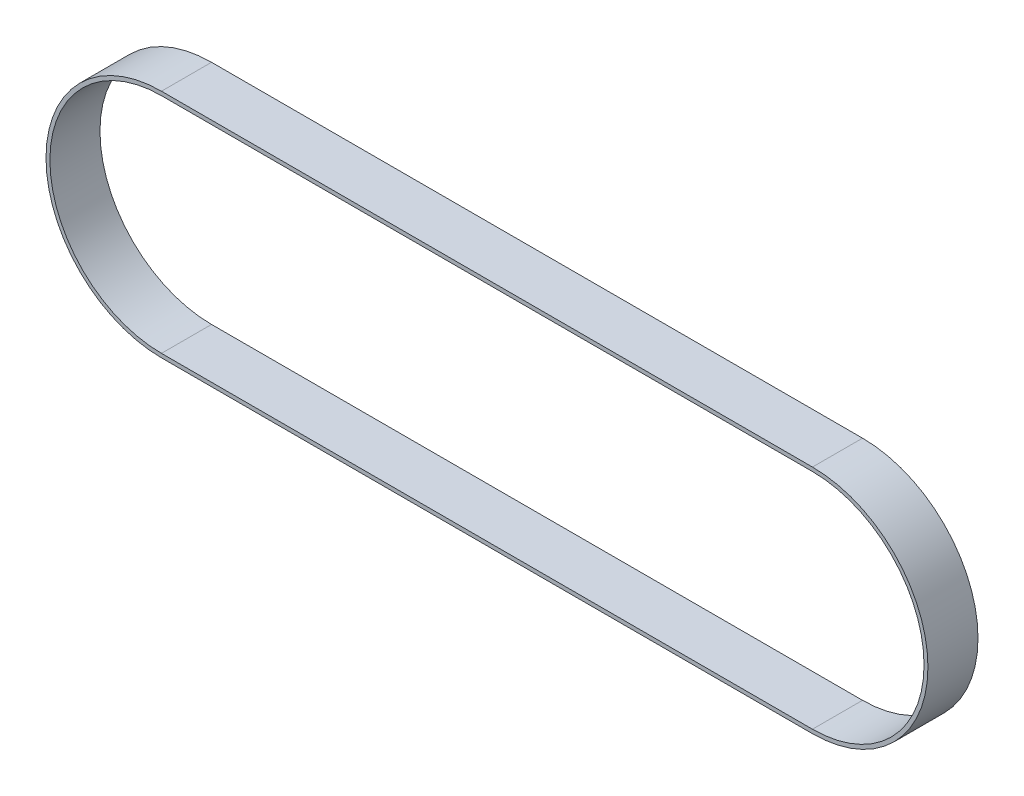
ISO-10303-21;
HEADER;
FILE_DESCRIPTION(('STEP AP214'),'2;1');
FILE_NAME('part.step','',(''),(''),'','','');
FILE_SCHEMA(('AUTOMOTIVE_DESIGN { 1 0 10303 214 1 1 1 1 }'));
ENDSEC;
DATA;
#1=APPLICATION_CONTEXT('core data for automotive mechanical design processes');
#2=APPLICATION_PROTOCOL_DEFINITION('international standard','automotive_design',2000,#1);
#3=PRODUCT_CONTEXT('',#1,'mechanical');
#4=PRODUCT('Part','Part','',(#3));
#5=PRODUCT_RELATED_PRODUCT_CATEGORY('part','',(#4));
#6=PRODUCT_DEFINITION_FORMATION('','',#4);
#7=PRODUCT_DEFINITION_CONTEXT('part definition',#1,'design');
#8=PRODUCT_DEFINITION('design','',#6,#7);
#9=PRODUCT_DEFINITION_SHAPE('','',#8);
#10=(LENGTH_UNIT() NAMED_UNIT(*) SI_UNIT(.MILLI.,.METRE.));
#11=(NAMED_UNIT(*) PLANE_ANGLE_UNIT() SI_UNIT($,.RADIAN.));
#12=(NAMED_UNIT(*) SI_UNIT($,.STERADIAN.) SOLID_ANGLE_UNIT());
#13=UNCERTAINTY_MEASURE_WITH_UNIT(LENGTH_MEASURE(1.E-05),#10,'distance_accuracy_value','');
#14=(GEOMETRIC_REPRESENTATION_CONTEXT(3) GLOBAL_UNCERTAINTY_ASSIGNED_CONTEXT((#13)) GLOBAL_UNIT_ASSIGNED_CONTEXT((#10,
#11,#12)) REPRESENTATION_CONTEXT('',''));
#15=CARTESIAN_POINT('',(0.,0.,0.));
#16=DIRECTION('',(0.,0.,1.));
#17=DIRECTION('',(1.,0.,0.));
#18=AXIS2_PLACEMENT_3D('',#15,#16,#17);
#19=CARTESIAN_POINT('',(0.,0.,15.));
#20=DIRECTION('',(0.,0.,1.));
#21=DIRECTION('',(1.,0.,0.));
#22=AXIS2_PLACEMENT_3D('',#19,#20,#21);
#23=PLANE('',#22);
#24=CARTESIAN_POINT('',(0.,0.,15.));
#25=DIRECTION('',(0.,0.,1.));
#26=DIRECTION('',(1.,0.,0.));
#27=AXIS2_PLACEMENT_3D('',#24,#25,#26);
#28=CIRCLE('',#27,34.5948);
#29=CARTESIAN_POINT('',(0.,34.5948,15.));
#30=VERTEX_POINT('',#29);
#31=CARTESIAN_POINT('',(0.,-34.5948,15.));
#32=VERTEX_POINT('',#31);
#33=EDGE_CURVE('E135',#30,#32,#28,.T.);
#34=ORIENTED_EDGE('',*,*,#33,.T.);
#35=DIRECTION('',(1.,0.,0.));
#36=VECTOR('',#35,1.);
#37=CARTESIAN_POINT('',(0.,-34.5948,15.));
#38=LINE('',#37,#36);
#39=CARTESIAN_POINT('',(195.0466,-34.5948,15.));
#40=VERTEX_POINT('',#39);
#41=EDGE_CURVE('E138',#32,#40,#38,.T.);
#42=ORIENTED_EDGE('',*,*,#41,.T.);
#43=CARTESIAN_POINT('',(195.0466,0.,15.));
#44=DIRECTION('',(0.,0.,1.));
#45=DIRECTION('',(1.,0.,0.));
#46=AXIS2_PLACEMENT_3D('',#43,#44,#45);
#47=CIRCLE('',#46,34.5948);
#48=CARTESIAN_POINT('',(195.0466,34.5948,15.));
#49=VERTEX_POINT('',#48);
#50=EDGE_CURVE('E141',#40,#49,#47,.T.);
#51=ORIENTED_EDGE('',*,*,#50,.T.);
#52=DIRECTION('',(-1.,0.,0.));
#53=VECTOR('',#52,1.);
#54=CARTESIAN_POINT('',(0.,34.5948,15.));
#55=LINE('',#54,#53);
#56=EDGE_CURVE('E143',#49,#30,#55,.T.);
#57=ORIENTED_EDGE('',*,*,#56,.T.);
#58=EDGE_LOOP('',(#34,#42,#51,#57));
#59=FACE_BOUND('',#58,.T.);
#60=DIRECTION('',(1.,0.,0.));
#61=VECTOR('',#60,1.);
#62=CARTESIAN_POINT('',(0.,-33.4264,15.));
#63=LINE('',#62,#61);
#64=CARTESIAN_POINT('',(0.,-33.4264,15.));
#65=VERTEX_POINT('',#64);
#66=CARTESIAN_POINT('',(195.0466,-33.4264,15.));
#67=VERTEX_POINT('',#66);
#68=EDGE_CURVE('E107',#65,#67,#63,.T.);
#69=ORIENTED_EDGE('',*,*,#68,.F.);
#70=CARTESIAN_POINT('',(0.,0.,15.));
#71=DIRECTION('',(0.,0.,1.));
#72=DIRECTION('',(1.,0.,0.));
#73=AXIS2_PLACEMENT_3D('',#70,#71,#72);
#74=CIRCLE('',#73,33.4264);
#75=CARTESIAN_POINT('',(0.,33.4264,15.));
#76=VERTEX_POINT('',#75);
#77=EDGE_CURVE('E99',#76,#65,#74,.T.);
#78=ORIENTED_EDGE('',*,*,#77,.F.);
#79=DIRECTION('',(-1.,0.,0.));
#80=VECTOR('',#79,1.);
#81=CARTESIAN_POINT('',(0.,33.4264,15.));
#82=LINE('',#81,#80);
#83=CARTESIAN_POINT('',(195.0466,33.4264,15.));
#84=VERTEX_POINT('',#83);
#85=EDGE_CURVE('E121',#84,#76,#82,.T.);
#86=ORIENTED_EDGE('',*,*,#85,.F.);
#87=CARTESIAN_POINT('',(195.0466,0.,15.));
#88=DIRECTION('',(0.,0.,1.));
#89=DIRECTION('',(1.,0.,0.));
#90=AXIS2_PLACEMENT_3D('',#87,#88,#89);
#91=CIRCLE('',#90,33.4264);
#92=EDGE_CURVE('E119',#67,#84,#91,.T.);
#93=ORIENTED_EDGE('',*,*,#92,.F.);
#94=EDGE_LOOP('',(#69,#78,#86,#93));
#95=FACE_BOUND('',#94,.T.);
#96=ADVANCED_FACE('F34',(#59,#95),#23,.T.);
#97=CARTESIAN_POINT('',(0.,0.,0.));
#98=DIRECTION('',(0.,0.,1.));
#99=DIRECTION('',(1.,0.,0.));
#100=AXIS2_PLACEMENT_3D('',#97,#98,#99);
#101=PLANE('',#100);
#102=CARTESIAN_POINT('',(0.,0.,0.));
#103=DIRECTION('',(0.,0.,1.));
#104=DIRECTION('',(1.,0.,0.));
#105=AXIS2_PLACEMENT_3D('',#102,#103,#104);
#106=CIRCLE('',#105,34.5948);
#107=CARTESIAN_POINT('',(0.,34.5948,0.));
#108=VERTEX_POINT('',#107);
#109=CARTESIAN_POINT('',(0.,-34.5948,0.));
#110=VERTEX_POINT('',#109);
#111=EDGE_CURVE('E115',#108,#110,#106,.T.);
#112=ORIENTED_EDGE('',*,*,#111,.F.);
#113=DIRECTION('',(-1.,0.,0.));
#114=VECTOR('',#113,1.);
#115=CARTESIAN_POINT('',(0.,34.5948,0.));
#116=LINE('',#115,#114);
#117=CARTESIAN_POINT('',(195.0466,34.5948,0.));
#118=VERTEX_POINT('',#117);
#119=EDGE_CURVE('E139',#118,#108,#116,.T.);
#120=ORIENTED_EDGE('',*,*,#119,.F.);
#121=CARTESIAN_POINT('',(195.0466,0.,0.));
#122=DIRECTION('',(0.,0.,1.));
#123=DIRECTION('',(1.,0.,0.));
#124=AXIS2_PLACEMENT_3D('',#121,#122,#123);
#125=CIRCLE('',#124,34.5948);
#126=CARTESIAN_POINT('',(195.0466,-34.5948,0.));
#127=VERTEX_POINT('',#126);
#128=EDGE_CURVE('E150',#127,#118,#125,.T.);
#129=ORIENTED_EDGE('',*,*,#128,.F.);
#130=DIRECTION('',(1.,0.,0.));
#131=VECTOR('',#130,1.);
#132=CARTESIAN_POINT('',(0.,-34.5948,0.));
#133=LINE('',#132,#131);
#134=EDGE_CURVE('E148',#110,#127,#133,.T.);
#135=ORIENTED_EDGE('',*,*,#134,.F.);
#136=EDGE_LOOP('',(#112,#120,#129,#135));
#137=FACE_BOUND('',#136,.T.);
#138=CARTESIAN_POINT('',(0.,0.,0.));
#139=DIRECTION('',(0.,0.,1.));
#140=DIRECTION('',(1.,0.,0.));
#141=AXIS2_PLACEMENT_3D('',#138,#139,#140);
#142=CIRCLE('',#141,33.4264);
#143=CARTESIAN_POINT('',(0.,33.4264,0.));
#144=VERTEX_POINT('',#143);
#145=CARTESIAN_POINT('',(0.,-33.4264,0.));
#146=VERTEX_POINT('',#145);
#147=EDGE_CURVE('E57',#144,#146,#142,.T.);
#148=ORIENTED_EDGE('',*,*,#147,.T.);
#149=DIRECTION('',(1.,0.,0.));
#150=VECTOR('',#149,1.);
#151=CARTESIAN_POINT('',(0.,-33.4264,0.));
#152=LINE('',#151,#150);
#153=CARTESIAN_POINT('',(195.0466,-33.4264,0.));
#154=VERTEX_POINT('',#153);
#155=EDGE_CURVE('E114',#146,#154,#152,.T.);
#156=ORIENTED_EDGE('',*,*,#155,.T.);
#157=CARTESIAN_POINT('',(195.0466,0.,0.));
#158=DIRECTION('',(0.,0.,1.));
#159=DIRECTION('',(1.,0.,0.));
#160=AXIS2_PLACEMENT_3D('',#157,#158,#159);
#161=CIRCLE('',#160,33.4264);
#162=CARTESIAN_POINT('',(195.0466,33.4264,0.));
#163=VERTEX_POINT('',#162);
#164=EDGE_CURVE('E127',#154,#163,#161,.T.);
#165=ORIENTED_EDGE('',*,*,#164,.T.);
#166=DIRECTION('',(-1.,0.,0.));
#167=VECTOR('',#166,1.);
#168=CARTESIAN_POINT('',(0.,33.4264,0.));
#169=LINE('',#168,#167);
#170=EDGE_CURVE('E108',#163,#144,#169,.T.);
#171=ORIENTED_EDGE('',*,*,#170,.T.);
#172=EDGE_LOOP('',(#148,#156,#165,#171));
#173=FACE_BOUND('',#172,.T.);
#174=ADVANCED_FACE('F168',(#137,#173),#101,.F.);
#175=CARTESIAN_POINT('',(0.,0.,15.));
#176=DIRECTION('',(0.,0.,-1.));
#177=DIRECTION('',(-1.,0.,0.));
#178=AXIS2_PLACEMENT_3D('',#175,#176,#177);
#179=CYLINDRICAL_SURFACE('',#178,34.5948);
#180=ORIENTED_EDGE('',*,*,#111,.T.);
#181=DIRECTION('',(0.,0.,-1.));
#182=VECTOR('',#181,1.);
#183=CARTESIAN_POINT('',(0.,-34.5948,15.));
#184=LINE('',#183,#182);
#185=EDGE_CURVE('E11',#32,#110,#184,.T.);
#186=ORIENTED_EDGE('',*,*,#185,.F.);
#187=ORIENTED_EDGE('',*,*,#33,.F.);
#188=DIRECTION('',(0.,0.,-1.));
#189=VECTOR('',#188,1.);
#190=CARTESIAN_POINT('',(0.,34.5948,15.));
#191=LINE('',#190,#189);
#192=EDGE_CURVE('E145',#30,#108,#191,.T.);
#193=ORIENTED_EDGE('',*,*,#192,.T.);
#194=EDGE_LOOP('',(#180,#186,#187,#193));
#195=FACE_BOUND('',#194,.T.);
#196=ADVANCED_FACE('F36',(#195),#179,.T.);
#197=CARTESIAN_POINT('',(0.,-34.5948,15.));
#198=DIRECTION('',(0.,1.,0.));
#199=DIRECTION('',(0.,0.,1.));
#200=AXIS2_PLACEMENT_3D('',#197,#198,#199);
#201=PLANE('',#200);
#202=ORIENTED_EDGE('',*,*,#134,.T.);
#203=DIRECTION('',(0.,0.,-1.));
#204=VECTOR('',#203,1.);
#205=CARTESIAN_POINT('',(195.0466,-34.5948,15.));
#206=LINE('',#205,#204);
#207=EDGE_CURVE('E42',#40,#127,#206,.T.);
#208=ORIENTED_EDGE('',*,*,#207,.F.);
#209=ORIENTED_EDGE('',*,*,#41,.F.);
#210=ORIENTED_EDGE('',*,*,#185,.T.);
#211=EDGE_LOOP('',(#202,#208,#209,#210));
#212=FACE_BOUND('',#211,.T.);
#213=ADVANCED_FACE('F178',(#212),#201,.F.);
#214=CARTESIAN_POINT('',(195.0466,0.,15.));
#215=DIRECTION('',(0.,0.,-1.));
#216=DIRECTION('',(-1.,0.,0.));
#217=AXIS2_PLACEMENT_3D('',#214,#215,#216);
#218=CYLINDRICAL_SURFACE('',#217,34.5948);
#219=ORIENTED_EDGE('',*,*,#128,.T.);
#220=DIRECTION('',(0.,0.,-1.));
#221=VECTOR('',#220,1.);
#222=CARTESIAN_POINT('',(195.0466,34.5948,15.));
#223=LINE('',#222,#221);
#224=EDGE_CURVE('E155',#49,#118,#223,.T.);
#225=ORIENTED_EDGE('',*,*,#224,.F.);
#226=ORIENTED_EDGE('',*,*,#50,.F.);
#227=ORIENTED_EDGE('',*,*,#207,.T.);
#228=EDGE_LOOP('',(#219,#225,#226,#227));
#229=FACE_BOUND('',#228,.T.);
#230=ADVANCED_FACE('F162',(#229),#218,.T.);
#231=CARTESIAN_POINT('',(0.,34.5948,15.));
#232=DIRECTION('',(0.,-1.,0.));
#233=DIRECTION('',(0.,0.,-1.));
#234=AXIS2_PLACEMENT_3D('',#231,#232,#233);
#235=PLANE('',#234);
#236=ORIENTED_EDGE('',*,*,#119,.T.);
#237=ORIENTED_EDGE('',*,*,#192,.F.);
#238=ORIENTED_EDGE('',*,*,#56,.F.);
#239=ORIENTED_EDGE('',*,*,#224,.T.);
#240=EDGE_LOOP('',(#236,#237,#238,#239));
#241=FACE_BOUND('',#240,.T.);
#242=ADVANCED_FACE('F172',(#241),#235,.F.);
#243=CARTESIAN_POINT('',(0.,0.,15.));
#244=DIRECTION('',(0.,0.,-1.));
#245=DIRECTION('',(-1.,0.,0.));
#246=AXIS2_PLACEMENT_3D('',#243,#244,#245);
#247=CYLINDRICAL_SURFACE('',#246,33.4264);
#248=ORIENTED_EDGE('',*,*,#147,.F.);
#249=DIRECTION('',(0.,0.,-1.));
#250=VECTOR('',#249,1.);
#251=CARTESIAN_POINT('',(0.,33.4264,15.));
#252=LINE('',#251,#250);
#253=EDGE_CURVE('E103',#76,#144,#252,.T.);
#254=ORIENTED_EDGE('',*,*,#253,.F.);
#255=ORIENTED_EDGE('',*,*,#77,.T.);
#256=DIRECTION('',(0.,0.,-1.));
#257=VECTOR('',#256,1.);
#258=CARTESIAN_POINT('',(0.,-33.4264,15.));
#259=LINE('',#258,#257);
#260=EDGE_CURVE('E102',#65,#146,#259,.T.);
#261=ORIENTED_EDGE('',*,*,#260,.T.);
#262=EDGE_LOOP('',(#248,#254,#255,#261));
#263=FACE_BOUND('',#262,.T.);
#264=ADVANCED_FACE('F101',(#263),#247,.F.);
#265=CARTESIAN_POINT('',(0.,-33.4264,15.));
#266=DIRECTION('',(0.,1.,0.));
#267=DIRECTION('',(0.,0.,1.));
#268=AXIS2_PLACEMENT_3D('',#265,#266,#267);
#269=PLANE('',#268);
#270=ORIENTED_EDGE('',*,*,#155,.F.);
#271=ORIENTED_EDGE('',*,*,#260,.F.);
#272=ORIENTED_EDGE('',*,*,#68,.T.);
#273=DIRECTION('',(0.,0.,-1.));
#274=VECTOR('',#273,1.);
#275=CARTESIAN_POINT('',(195.0466,-33.4264,15.));
#276=LINE('',#275,#274);
#277=EDGE_CURVE('E116',#67,#154,#276,.T.);
#278=ORIENTED_EDGE('',*,*,#277,.T.);
#279=EDGE_LOOP('',(#270,#271,#272,#278));
#280=FACE_BOUND('',#279,.T.);
#281=ADVANCED_FACE('F111',(#280),#269,.T.);
#282=CARTESIAN_POINT('',(195.0466,0.,15.));
#283=DIRECTION('',(0.,0.,-1.));
#284=DIRECTION('',(-1.,0.,0.));
#285=AXIS2_PLACEMENT_3D('',#282,#283,#284);
#286=CYLINDRICAL_SURFACE('',#285,33.4264);
#287=ORIENTED_EDGE('',*,*,#164,.F.);
#288=ORIENTED_EDGE('',*,*,#277,.F.);
#289=ORIENTED_EDGE('',*,*,#92,.T.);
#290=DIRECTION('',(0.,0.,-1.));
#291=VECTOR('',#290,1.);
#292=CARTESIAN_POINT('',(195.0466,33.4264,15.));
#293=LINE('',#292,#291);
#294=EDGE_CURVE('E49',#84,#163,#293,.T.);
#295=ORIENTED_EDGE('',*,*,#294,.T.);
#296=EDGE_LOOP('',(#287,#288,#289,#295));
#297=FACE_BOUND('',#296,.T.);
#298=ADVANCED_FACE('F201',(#297),#286,.F.);
#299=CARTESIAN_POINT('',(0.,33.4264,15.));
#300=DIRECTION('',(0.,-1.,0.));
#301=DIRECTION('',(0.,0.,-1.));
#302=AXIS2_PLACEMENT_3D('',#299,#300,#301);
#303=PLANE('',#302);
#304=ORIENTED_EDGE('',*,*,#170,.F.);
#305=ORIENTED_EDGE('',*,*,#294,.F.);
#306=ORIENTED_EDGE('',*,*,#85,.T.);
#307=ORIENTED_EDGE('',*,*,#253,.T.);
#308=EDGE_LOOP('',(#304,#305,#306,#307));
#309=FACE_BOUND('',#308,.T.);
#310=ADVANCED_FACE('F205',(#309),#303,.T.);
#311=CLOSED_SHELL('',(#96,#174,#196,#213,#230,#242,#264,#281,#298,#310));
#312=MANIFOLD_SOLID_BREP('B2',#311);
#313=ADVANCED_BREP_SHAPE_REPRESENTATION('',(#18,#312),#14);
#314=SHAPE_DEFINITION_REPRESENTATION(#9,#313);
ENDSEC;
END-ISO-10303-21;
